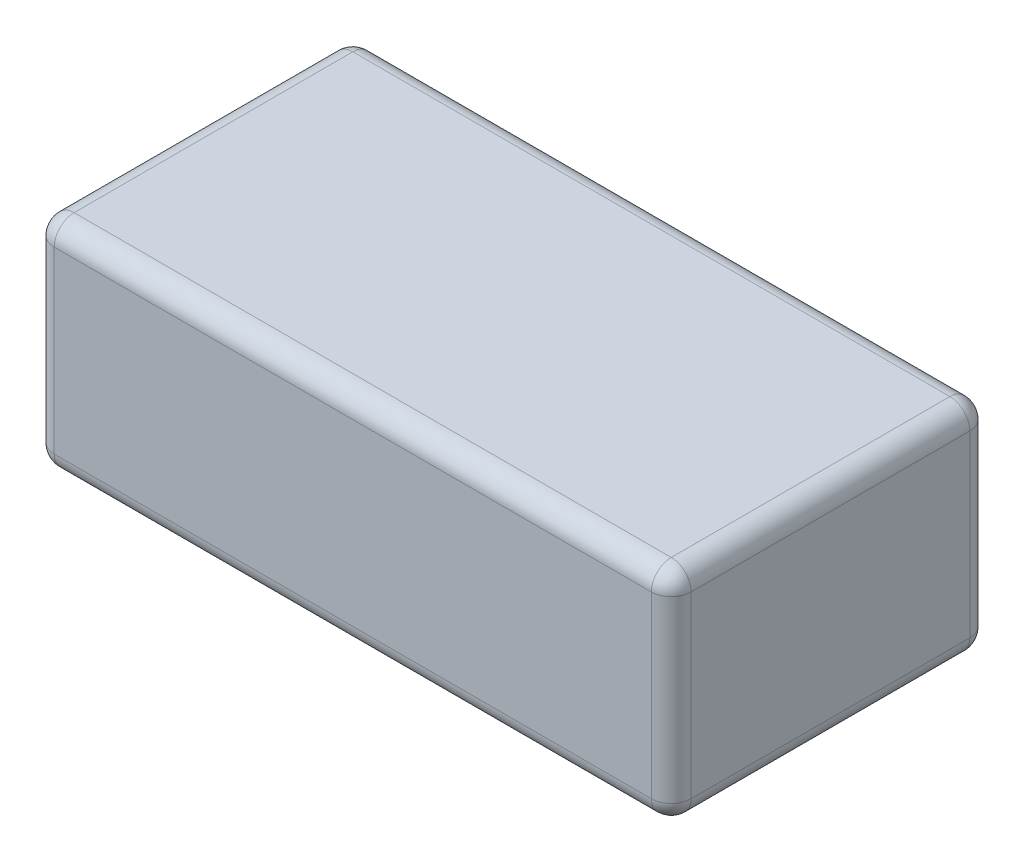
ISO-10303-21;
HEADER;
FILE_DESCRIPTION(('STEP AP214'),'2;1');
FILE_NAME('part.step','',(''),(''),'','','');
FILE_SCHEMA(('AUTOMOTIVE_DESIGN { 1 0 10303 214 1 1 1 1 }'));
ENDSEC;
DATA;
#1=APPLICATION_CONTEXT('core data for automotive mechanical design processes');
#2=APPLICATION_PROTOCOL_DEFINITION('international standard','automotive_design',2000,#1);
#3=PRODUCT_CONTEXT('',#1,'mechanical');
#4=PRODUCT('Part','Part','',(#3));
#5=PRODUCT_RELATED_PRODUCT_CATEGORY('part','',(#4));
#6=PRODUCT_DEFINITION_FORMATION('','',#4);
#7=PRODUCT_DEFINITION_CONTEXT('part definition',#1,'design');
#8=PRODUCT_DEFINITION('design','',#6,#7);
#9=PRODUCT_DEFINITION_SHAPE('','',#8);
#10=(LENGTH_UNIT() NAMED_UNIT(*) SI_UNIT(.MILLI.,.METRE.));
#11=(NAMED_UNIT(*) PLANE_ANGLE_UNIT() SI_UNIT($,.RADIAN.));
#12=(NAMED_UNIT(*) SI_UNIT($,.STERADIAN.) SOLID_ANGLE_UNIT());
#13=UNCERTAINTY_MEASURE_WITH_UNIT(LENGTH_MEASURE(1.E-05),#10,'distance_accuracy_value','');
#14=(GEOMETRIC_REPRESENTATION_CONTEXT(3) GLOBAL_UNCERTAINTY_ASSIGNED_CONTEXT((#13)) GLOBAL_UNIT_ASSIGNED_CONTEXT((#10,
#11,#12)) REPRESENTATION_CONTEXT('',''));
#15=CARTESIAN_POINT('',(0.,0.,0.));
#16=DIRECTION('',(0.,0.,1.));
#17=DIRECTION('',(1.,0.,0.));
#18=AXIS2_PLACEMENT_3D('',#15,#16,#17);
#19=CARTESIAN_POINT('',(0.75,0.05,0.35));
#20=DIRECTION('',(1.,0.,0.));
#21=DIRECTION('',(0.,0.,-1.));
#22=AXIS2_PLACEMENT_3D('',#19,#20,#21);
#23=SPHERICAL_SURFACE('',#22,0.05);
#24=CARTESIAN_POINT('',(0.75,0.05,0.35));
#25=DIRECTION('',(-1.,0.,0.));
#26=DIRECTION('',(0.,0.,1.));
#27=AXIS2_PLACEMENT_3D('',#24,#25,#26);
#28=CIRCLE('',#27,0.05);
#29=CARTESIAN_POINT('',(0.75,0.,0.35));
#30=VERTEX_POINT('',#29);
#31=CARTESIAN_POINT('',(0.75,0.049999999999988,0.4));
#32=VERTEX_POINT('',#31);
#33=EDGE_CURVE('E111',#30,#32,#28,.T.);
#34=ORIENTED_EDGE('',*,*,#33,.F.);
#35=CARTESIAN_POINT('',(0.75,0.05,0.35));
#36=DIRECTION('',(0.,0.,1.));
#37=DIRECTION('',(1.,0.,0.));
#38=AXIS2_PLACEMENT_3D('',#35,#36,#37);
#39=CIRCLE('',#38,0.05);
#40=CARTESIAN_POINT('',(0.8,0.05,0.35));
#41=VERTEX_POINT('',#40);
#42=EDGE_CURVE('E122',#41,#30,#39,.F.);
#43=ORIENTED_EDGE('',*,*,#42,.F.);
#44=CARTESIAN_POINT('',(0.75,0.05,0.35));
#45=DIRECTION('',(0.,-1.,0.));
#46=DIRECTION('',(0.,0.,-1.));
#47=AXIS2_PLACEMENT_3D('',#44,#45,#46);
#48=CIRCLE('',#47,0.05);
#49=EDGE_CURVE('E131',#32,#41,#48,.F.);
#50=ORIENTED_EDGE('',*,*,#49,.F.);
#51=EDGE_LOOP('',(#34,#43,#50));
#52=FACE_BOUND('',#51,.T.);
#53=ADVANCED_FACE('F17',(#52),#23,.T.);
#54=CARTESIAN_POINT('',(-0.75,0.05,0.35));
#55=DIRECTION('',(1.,0.,0.));
#56=DIRECTION('',(0.,0.,-1.));
#57=AXIS2_PLACEMENT_3D('',#54,#55,#56);
#58=SPHERICAL_SURFACE('',#57,0.05);
#59=CARTESIAN_POINT('',(-0.75,0.05,0.35));
#60=DIRECTION('',(0.,-1.,0.));
#61=DIRECTION('',(0.,0.,-1.));
#62=AXIS2_PLACEMENT_3D('',#59,#60,#61);
#63=CIRCLE('',#62,0.05);
#64=CARTESIAN_POINT('',(-0.8,0.05,0.35));
#65=VERTEX_POINT('',#64);
#66=CARTESIAN_POINT('',(-0.75,0.05,0.4));
#67=VERTEX_POINT('',#66);
#68=EDGE_CURVE('E261',#65,#67,#63,.F.);
#69=ORIENTED_EDGE('',*,*,#68,.F.);
#70=CARTESIAN_POINT('',(-0.75,0.05,0.35));
#71=DIRECTION('',(0.,0.,-1.));
#72=DIRECTION('',(-1.,0.,0.));
#73=AXIS2_PLACEMENT_3D('',#70,#71,#72);
#74=CIRCLE('',#73,0.05);
#75=CARTESIAN_POINT('',(-0.75,0.,0.35));
#76=VERTEX_POINT('',#75);
#77=EDGE_CURVE('E270',#76,#65,#74,.T.);
#78=ORIENTED_EDGE('',*,*,#77,.F.);
#79=CARTESIAN_POINT('',(-0.75,0.05,0.35));
#80=DIRECTION('',(-1.,0.,0.));
#81=DIRECTION('',(0.,0.,1.));
#82=AXIS2_PLACEMENT_3D('',#79,#80,#81);
#83=CIRCLE('',#82,0.05);
#84=EDGE_CURVE('E114',#67,#76,#83,.F.);
#85=ORIENTED_EDGE('',*,*,#84,.F.);
#86=EDGE_LOOP('',(#69,#78,#85));
#87=FACE_BOUND('',#86,.T.);
#88=ADVANCED_FACE('F151',(#87),#58,.T.);
#89=CARTESIAN_POINT('',(-0.75,0.05,-0.35));
#90=DIRECTION('',(1.,0.,0.));
#91=DIRECTION('',(0.,0.,-1.));
#92=AXIS2_PLACEMENT_3D('',#89,#90,#91);
#93=SPHERICAL_SURFACE('',#92,0.05);
#94=CARTESIAN_POINT('',(-0.75,0.05,-0.35));
#95=DIRECTION('',(0.,-1.,0.));
#96=DIRECTION('',(0.,0.,-1.));
#97=AXIS2_PLACEMENT_3D('',#94,#95,#96);
#98=CIRCLE('',#97,0.05);
#99=CARTESIAN_POINT('',(-0.75,0.05,-0.4));
#100=VERTEX_POINT('',#99);
#101=CARTESIAN_POINT('',(-0.8,0.05,-0.35));
#102=VERTEX_POINT('',#101);
#103=EDGE_CURVE('E256',#100,#102,#98,.F.);
#104=ORIENTED_EDGE('',*,*,#103,.F.);
#105=CARTESIAN_POINT('',(-0.75,0.05,-0.35));
#106=DIRECTION('',(1.,0.,0.));
#107=DIRECTION('',(0.,0.,-1.));
#108=AXIS2_PLACEMENT_3D('',#105,#106,#107);
#109=CIRCLE('',#108,0.05);
#110=CARTESIAN_POINT('',(-0.75,0.,-0.35));
#111=VERTEX_POINT('',#110);
#112=EDGE_CURVE('E253',#111,#100,#109,.T.);
#113=ORIENTED_EDGE('',*,*,#112,.F.);
#114=CARTESIAN_POINT('',(-0.75,0.05,-0.35));
#115=DIRECTION('',(0.,0.,-1.));
#116=DIRECTION('',(-1.,0.,0.));
#117=AXIS2_PLACEMENT_3D('',#114,#115,#116);
#118=CIRCLE('',#117,0.05);
#119=EDGE_CURVE('E267',#102,#111,#118,.F.);
#120=ORIENTED_EDGE('',*,*,#119,.F.);
#121=EDGE_LOOP('',(#104,#113,#120));
#122=FACE_BOUND('',#121,.T.);
#123=ADVANCED_FACE('F147',(#122),#93,.T.);
#124=CARTESIAN_POINT('',(0.75,0.05,-0.35));
#125=DIRECTION('',(1.,0.,0.));
#126=DIRECTION('',(0.,0.,-1.));
#127=AXIS2_PLACEMENT_3D('',#124,#125,#126);
#128=SPHERICAL_SURFACE('',#127,0.05);
#129=CARTESIAN_POINT('',(0.75,0.05,-0.35));
#130=DIRECTION('',(1.,0.,0.));
#131=DIRECTION('',(0.,0.,-1.));
#132=AXIS2_PLACEMENT_3D('',#129,#130,#131);
#133=CIRCLE('',#132,0.05);
#134=CARTESIAN_POINT('',(0.75,0.05,-0.4));
#135=VERTEX_POINT('',#134);
#136=CARTESIAN_POINT('',(0.75,0.,-0.35));
#137=VERTEX_POINT('',#136);
#138=EDGE_CURVE('E251',#135,#137,#133,.F.);
#139=ORIENTED_EDGE('',*,*,#138,.F.);
#140=CARTESIAN_POINT('',(0.75,0.05,-0.35));
#141=DIRECTION('',(0.,-1.,0.));
#142=DIRECTION('',(0.,0.,-1.));
#143=AXIS2_PLACEMENT_3D('',#140,#141,#142);
#144=CIRCLE('',#143,0.05);
#145=CARTESIAN_POINT('',(0.8,0.05,-0.35));
#146=VERTEX_POINT('',#145);
#147=EDGE_CURVE('E258',#146,#135,#144,.F.);
#148=ORIENTED_EDGE('',*,*,#147,.F.);
#149=CARTESIAN_POINT('',(0.75,0.05,-0.35));
#150=DIRECTION('',(0.,0.,1.));
#151=DIRECTION('',(1.,0.,0.));
#152=AXIS2_PLACEMENT_3D('',#149,#150,#151);
#153=CIRCLE('',#152,0.05);
#154=EDGE_CURVE('E133',#137,#146,#153,.T.);
#155=ORIENTED_EDGE('',*,*,#154,.F.);
#156=EDGE_LOOP('',(#139,#148,#155));
#157=FACE_BOUND('',#156,.T.);
#158=ADVANCED_FACE('F143',(#157),#128,.T.);
#159=CARTESIAN_POINT('',(0.75,0.05,0.4));
#160=DIRECTION('',(0.,0.,1.));
#161=DIRECTION('',(1.,0.,0.));
#162=AXIS2_PLACEMENT_3D('',#159,#160,#161);
#163=CYLINDRICAL_SURFACE('',#162,0.05);
#164=ORIENTED_EDGE('',*,*,#154,.T.);
#165=DIRECTION('',(0.,0.,1.));
#166=VECTOR('',#165,1.);
#167=CARTESIAN_POINT('',(0.8,0.05,0.4));
#168=LINE('',#167,#166);
#169=EDGE_CURVE('E127',#146,#41,#168,.T.);
#170=ORIENTED_EDGE('',*,*,#169,.T.);
#171=ORIENTED_EDGE('',*,*,#42,.T.);
#172=DIRECTION('',(0.,0.,1.));
#173=VECTOR('',#172,1.);
#174=CARTESIAN_POINT('',(0.75,0.,0.4));
#175=LINE('',#174,#173);
#176=EDGE_CURVE('E124',#30,#137,#175,.F.);
#177=ORIENTED_EDGE('',*,*,#176,.T.);
#178=EDGE_LOOP('',(#164,#170,#171,#177));
#179=FACE_BOUND('',#178,.T.);
#180=ADVANCED_FACE('F123',(#179),#163,.T.);
#181=CARTESIAN_POINT('',(0.75,0.55,0.35));
#182=DIRECTION('',(0.,-1.,0.));
#183=DIRECTION('',(0.,0.,-1.));
#184=AXIS2_PLACEMENT_3D('',#181,#182,#183);
#185=CYLINDRICAL_SURFACE('',#184,0.05);
#186=ORIENTED_EDGE('',*,*,#49,.T.);
#187=DIRECTION('',(0.,1.,0.));
#188=VECTOR('',#187,1.);
#189=CARTESIAN_POINT('',(0.8,0.55,0.35));
#190=LINE('',#189,#188);
#191=CARTESIAN_POINT('',(0.8,0.5,0.35));
#192=VERTEX_POINT('',#191);
#193=EDGE_CURVE('E247',#41,#192,#190,.T.);
#194=ORIENTED_EDGE('',*,*,#193,.T.);
#195=CARTESIAN_POINT('',(0.75,0.5,0.35));
#196=DIRECTION('',(0.,-1.,0.));
#197=DIRECTION('',(1.,0.,0.));
#198=AXIS2_PLACEMENT_3D('',#195,#196,#197);
#199=CIRCLE('',#198,0.05);
#200=CARTESIAN_POINT('',(0.75,0.5,0.4));
#201=VERTEX_POINT('',#200);
#202=EDGE_CURVE('E242',#201,#192,#199,.F.);
#203=ORIENTED_EDGE('',*,*,#202,.F.);
#204=DIRECTION('',(0.,1.,0.));
#205=VECTOR('',#204,1.);
#206=CARTESIAN_POINT('',(0.75,0.55,0.4));
#207=LINE('',#206,#205);
#208=EDGE_CURVE('E116',#201,#32,#207,.F.);
#209=ORIENTED_EDGE('',*,*,#208,.T.);
#210=EDGE_LOOP('',(#186,#194,#203,#209));
#211=FACE_BOUND('',#210,.T.);
#212=ADVANCED_FACE('F274',(#211),#185,.T.);
#213=CARTESIAN_POINT('',(-0.75,0.05,0.4));
#214=DIRECTION('',(0.,0.,-1.));
#215=DIRECTION('',(-1.,0.,0.));
#216=AXIS2_PLACEMENT_3D('',#213,#214,#215);
#217=CYLINDRICAL_SURFACE('',#216,0.05);
#218=ORIENTED_EDGE('',*,*,#119,.T.);
#219=DIRECTION('',(0.,0.,-1.));
#220=VECTOR('',#219,1.);
#221=CARTESIAN_POINT('',(-0.75,0.,0.4));
#222=LINE('',#221,#220);
#223=EDGE_CURVE('E264',#111,#76,#222,.F.);
#224=ORIENTED_EDGE('',*,*,#223,.T.);
#225=ORIENTED_EDGE('',*,*,#77,.T.);
#226=DIRECTION('',(0.,0.,-1.));
#227=VECTOR('',#226,1.);
#228=CARTESIAN_POINT('',(-0.8,0.05,0.4));
#229=LINE('',#228,#227);
#230=EDGE_CURVE('E220',#65,#102,#229,.T.);
#231=ORIENTED_EDGE('',*,*,#230,.T.);
#232=EDGE_LOOP('',(#218,#224,#225,#231));
#233=FACE_BOUND('',#232,.T.);
#234=ADVANCED_FACE('F361',(#233),#217,.T.);
#235=CARTESIAN_POINT('',(-0.75,0.55,0.35));
#236=DIRECTION('',(0.,-1.,0.));
#237=DIRECTION('',(0.,0.,-1.));
#238=AXIS2_PLACEMENT_3D('',#235,#236,#237);
#239=CYLINDRICAL_SURFACE('',#238,0.05);
#240=ORIENTED_EDGE('',*,*,#68,.T.);
#241=DIRECTION('',(0.,1.,0.));
#242=VECTOR('',#241,1.);
#243=CARTESIAN_POINT('',(-0.75,0.55,0.4));
#244=LINE('',#243,#242);
#245=CARTESIAN_POINT('',(-0.75,0.5,0.4));
#246=VERTEX_POINT('',#245);
#247=EDGE_CURVE('E241',#67,#246,#244,.T.);
#248=ORIENTED_EDGE('',*,*,#247,.T.);
#249=CARTESIAN_POINT('',(-0.75,0.5,0.35));
#250=DIRECTION('',(0.,-1.,0.));
#251=DIRECTION('',(1.,0.,0.));
#252=AXIS2_PLACEMENT_3D('',#249,#250,#251);
#253=CIRCLE('',#252,0.05);
#254=CARTESIAN_POINT('',(-0.8,0.5,0.35));
#255=VERTEX_POINT('',#254);
#256=EDGE_CURVE('E223',#255,#246,#253,.F.);
#257=ORIENTED_EDGE('',*,*,#256,.F.);
#258=DIRECTION('',(0.,1.,0.));
#259=VECTOR('',#258,1.);
#260=CARTESIAN_POINT('',(-0.8,0.55,0.35));
#261=LINE('',#260,#259);
#262=EDGE_CURVE('E214',#255,#65,#261,.F.);
#263=ORIENTED_EDGE('',*,*,#262,.T.);
#264=EDGE_LOOP('',(#240,#248,#257,#263));
#265=FACE_BOUND('',#264,.T.);
#266=ADVANCED_FACE('F359',(#265),#239,.T.);
#267=CARTESIAN_POINT('',(0.75,0.55,-0.35));
#268=DIRECTION('',(0.,-1.,0.));
#269=DIRECTION('',(0.,0.,-1.));
#270=AXIS2_PLACEMENT_3D('',#267,#268,#269);
#271=CYLINDRICAL_SURFACE('',#270,0.05);
#272=ORIENTED_EDGE('',*,*,#147,.T.);
#273=DIRECTION('',(0.,1.,0.));
#274=VECTOR('',#273,1.);
#275=CARTESIAN_POINT('',(0.75,0.55,-0.4));
#276=LINE('',#275,#274);
#277=CARTESIAN_POINT('',(0.75,0.5,-0.4));
#278=VERTEX_POINT('',#277);
#279=EDGE_CURVE('E206',#135,#278,#276,.T.);
#280=ORIENTED_EDGE('',*,*,#279,.T.);
#281=CARTESIAN_POINT('',(0.75,0.5,-0.35));
#282=DIRECTION('',(0.,1.,0.));
#283=DIRECTION('',(1.,0.,0.));
#284=AXIS2_PLACEMENT_3D('',#281,#282,#283);
#285=CIRCLE('',#284,0.05);
#286=CARTESIAN_POINT('',(0.8,0.5,-0.35));
#287=VERTEX_POINT('',#286);
#288=EDGE_CURVE('E208',#287,#278,#285,.T.);
#289=ORIENTED_EDGE('',*,*,#288,.F.);
#290=DIRECTION('',(0.,1.,0.));
#291=VECTOR('',#290,1.);
#292=CARTESIAN_POINT('',(0.8,0.55,-0.35));
#293=LINE('',#292,#291);
#294=EDGE_CURVE('E117',#287,#146,#293,.F.);
#295=ORIENTED_EDGE('',*,*,#294,.T.);
#296=EDGE_LOOP('',(#272,#280,#289,#295));
#297=FACE_BOUND('',#296,.T.);
#298=ADVANCED_FACE('F310',(#297),#271,.T.);
#299=CARTESIAN_POINT('',(-0.75,0.55,-0.35));
#300=DIRECTION('',(0.,-1.,0.));
#301=DIRECTION('',(0.,0.,-1.));
#302=AXIS2_PLACEMENT_3D('',#299,#300,#301);
#303=CYLINDRICAL_SURFACE('',#302,0.05);
#304=CARTESIAN_POINT('',(-0.75,0.5,-0.35));
#305=DIRECTION('',(0.,1.,0.));
#306=DIRECTION('',(1.,0.,0.));
#307=AXIS2_PLACEMENT_3D('',#304,#305,#306);
#308=CIRCLE('',#307,0.05);
#309=CARTESIAN_POINT('',(-0.75,0.5,-0.4));
#310=VERTEX_POINT('',#309);
#311=CARTESIAN_POINT('',(-0.8,0.5,-0.35));
#312=VERTEX_POINT('',#311);
#313=EDGE_CURVE('E210',#310,#312,#308,.T.);
#314=ORIENTED_EDGE('',*,*,#313,.F.);
#315=DIRECTION('',(0.,1.,0.));
#316=VECTOR('',#315,1.);
#317=CARTESIAN_POINT('',(-0.75,0.55,-0.4));
#318=LINE('',#317,#316);
#319=EDGE_CURVE('E300',#310,#100,#318,.F.);
#320=ORIENTED_EDGE('',*,*,#319,.T.);
#321=ORIENTED_EDGE('',*,*,#103,.T.);
#322=DIRECTION('',(0.,1.,0.));
#323=VECTOR('',#322,1.);
#324=CARTESIAN_POINT('',(-0.8,0.55,-0.35));
#325=LINE('',#324,#323);
#326=EDGE_CURVE('E217',#102,#312,#325,.T.);
#327=ORIENTED_EDGE('',*,*,#326,.T.);
#328=EDGE_LOOP('',(#314,#320,#321,#327));
#329=FACE_BOUND('',#328,.T.);
#330=ADVANCED_FACE('F351',(#329),#303,.T.);
#331=CARTESIAN_POINT('',(0.8,0.,-0.4));
#332=DIRECTION('',(0.,-1.,0.));
#333=DIRECTION('',(0.,0.,-1.));
#334=AXIS2_PLACEMENT_3D('',#331,#332,#333);
#335=PLANE('',#334);
#336=DIRECTION('',(1.,0.,0.));
#337=VECTOR('',#336,1.);
#338=CARTESIAN_POINT('',(-0.8,0.,-0.35));
#339=LINE('',#338,#337);
#340=EDGE_CURVE('E101',#137,#111,#339,.F.);
#341=ORIENTED_EDGE('',*,*,#340,.F.);
#342=ORIENTED_EDGE('',*,*,#176,.F.);
#343=DIRECTION('',(-1.,0.,0.));
#344=VECTOR('',#343,1.);
#345=CARTESIAN_POINT('',(-0.8,0.,0.35));
#346=LINE('',#345,#344);
#347=EDGE_CURVE('E107',#76,#30,#346,.F.);
#348=ORIENTED_EDGE('',*,*,#347,.F.);
#349=ORIENTED_EDGE('',*,*,#223,.F.);
#350=EDGE_LOOP('',(#341,#342,#348,#349));
#351=FACE_BOUND('',#350,.T.);
#352=ADVANCED_FACE('F135',(#351),#335,.T.);
#353=CARTESIAN_POINT('',(0.8,0.55,0.4));
#354=DIRECTION('',(-1.,0.,0.));
#355=DIRECTION('',(0.,0.,1.));
#356=AXIS2_PLACEMENT_3D('',#353,#354,#355);
#357=PLANE('',#356);
#358=DIRECTION('',(0.,0.,-1.));
#359=VECTOR('',#358,1.);
#360=CARTESIAN_POINT('',(0.8,0.5,-0.4));
#361=LINE('',#360,#359);
#362=EDGE_CURVE('E291',#192,#287,#361,.T.);
#363=ORIENTED_EDGE('',*,*,#362,.F.);
#364=ORIENTED_EDGE('',*,*,#193,.F.);
#365=ORIENTED_EDGE('',*,*,#169,.F.);
#366=ORIENTED_EDGE('',*,*,#294,.F.);
#367=EDGE_LOOP('',(#363,#364,#365,#366));
#368=FACE_BOUND('',#367,.T.);
#369=ADVANCED_FACE('F346',(#368),#357,.F.);
#370=CARTESIAN_POINT('',(-0.8,0.05,0.35));
#371=DIRECTION('',(-1.,0.,0.));
#372=DIRECTION('',(0.,0.,1.));
#373=AXIS2_PLACEMENT_3D('',#370,#371,#372);
#374=CYLINDRICAL_SURFACE('',#373,0.05);
#375=ORIENTED_EDGE('',*,*,#347,.T.);
#376=ORIENTED_EDGE('',*,*,#33,.T.);
#377=DIRECTION('',(-1.,0.,0.));
#378=VECTOR('',#377,1.);
#379=CARTESIAN_POINT('',(-0.8,0.05,0.4));
#380=LINE('',#379,#378);
#381=EDGE_CURVE('E282',#32,#67,#380,.T.);
#382=ORIENTED_EDGE('',*,*,#381,.T.);
#383=ORIENTED_EDGE('',*,*,#84,.T.);
#384=EDGE_LOOP('',(#375,#376,#382,#383));
#385=FACE_BOUND('',#384,.T.);
#386=ADVANCED_FACE('F109',(#385),#374,.T.);
#387=CARTESIAN_POINT('',(0.75,0.5,0.35));
#388=DIRECTION('',(1.,0.,0.));
#389=DIRECTION('',(0.,0.,-1.));
#390=AXIS2_PLACEMENT_3D('',#387,#388,#389);
#391=SPHERICAL_SURFACE('',#390,0.05);
#392=ORIENTED_EDGE('',*,*,#202,.T.);
#393=CARTESIAN_POINT('',(0.75,0.5,0.35));
#394=DIRECTION('',(0.,0.,-1.));
#395=DIRECTION('',(-1.,0.,0.));
#396=AXIS2_PLACEMENT_3D('',#393,#394,#395);
#397=CIRCLE('',#396,0.05);
#398=CARTESIAN_POINT('',(0.75,0.55,0.349999999999904));
#399=VERTEX_POINT('',#398);
#400=EDGE_CURVE('E297',#399,#192,#397,.T.);
#401=ORIENTED_EDGE('',*,*,#400,.F.);
#402=CARTESIAN_POINT('',(0.75,0.5,0.35));
#403=DIRECTION('',(1.,0.,0.));
#404=DIRECTION('',(0.,0.,-1.));
#405=AXIS2_PLACEMENT_3D('',#402,#403,#404);
#406=CIRCLE('',#405,0.05);
#407=EDGE_CURVE('E284',#201,#399,#406,.F.);
#408=ORIENTED_EDGE('',*,*,#407,.F.);
#409=EDGE_LOOP('',(#392,#401,#408));
#410=FACE_BOUND('',#409,.T.);
#411=ADVANCED_FACE('F232',(#410),#391,.T.);
#412=CARTESIAN_POINT('',(-0.75,0.5,0.35));
#413=DIRECTION('',(1.,0.,0.));
#414=DIRECTION('',(0.,0.,-1.));
#415=AXIS2_PLACEMENT_3D('',#412,#413,#414);
#416=SPHERICAL_SURFACE('',#415,0.05);
#417=ORIENTED_EDGE('',*,*,#256,.T.);
#418=CARTESIAN_POINT('',(-0.75,0.5,0.35));
#419=DIRECTION('',(1.,0.,0.));
#420=DIRECTION('',(0.,0.,-1.));
#421=AXIS2_PLACEMENT_3D('',#418,#419,#420);
#422=CIRCLE('',#421,0.05);
#423=CARTESIAN_POINT('',(-0.75,0.55,0.35));
#424=VERTEX_POINT('',#423);
#425=EDGE_CURVE('E288',#424,#246,#422,.T.);
#426=ORIENTED_EDGE('',*,*,#425,.F.);
#427=CARTESIAN_POINT('',(-0.75,0.5,0.35));
#428=DIRECTION('',(0.,0.,1.));
#429=DIRECTION('',(1.,0.,0.));
#430=AXIS2_PLACEMENT_3D('',#427,#428,#429);
#431=CIRCLE('',#430,0.05);
#432=EDGE_CURVE('E331',#255,#424,#431,.F.);
#433=ORIENTED_EDGE('',*,*,#432,.F.);
#434=EDGE_LOOP('',(#417,#426,#433));
#435=FACE_BOUND('',#434,.T.);
#436=ADVANCED_FACE('F228',(#435),#416,.T.);
#437=CARTESIAN_POINT('',(-0.8,0.55,0.4));
#438=DIRECTION('',(1.,0.,0.));
#439=DIRECTION('',(0.,0.,-1.));
#440=AXIS2_PLACEMENT_3D('',#437,#438,#439);
#441=PLANE('',#440);
#442=DIRECTION('',(0.,0.,1.));
#443=VECTOR('',#442,1.);
#444=CARTESIAN_POINT('',(-0.8,0.5,-0.4));
#445=LINE('',#444,#443);
#446=EDGE_CURVE('E322',#312,#255,#445,.T.);
#447=ORIENTED_EDGE('',*,*,#446,.F.);
#448=ORIENTED_EDGE('',*,*,#326,.F.);
#449=ORIENTED_EDGE('',*,*,#230,.F.);
#450=ORIENTED_EDGE('',*,*,#262,.F.);
#451=EDGE_LOOP('',(#447,#448,#449,#450));
#452=FACE_BOUND('',#451,.T.);
#453=ADVANCED_FACE('F231',(#452),#441,.F.);
#454=CARTESIAN_POINT('',(-0.75,0.5,-0.35));
#455=DIRECTION('',(1.,0.,0.));
#456=DIRECTION('',(0.,0.,-1.));
#457=AXIS2_PLACEMENT_3D('',#454,#455,#456);
#458=SPHERICAL_SURFACE('',#457,0.05);
#459=CARTESIAN_POINT('',(-0.75,0.5,-0.35));
#460=DIRECTION('',(0.,0.,1.));
#461=DIRECTION('',(1.,0.,0.));
#462=AXIS2_PLACEMENT_3D('',#459,#460,#461);
#463=CIRCLE('',#462,0.05);
#464=CARTESIAN_POINT('',(-0.75,0.55,-0.35));
#465=VERTEX_POINT('',#464);
#466=EDGE_CURVE('E328',#465,#312,#463,.T.);
#467=ORIENTED_EDGE('',*,*,#466,.F.);
#468=CARTESIAN_POINT('',(-0.75,0.5,-0.35));
#469=DIRECTION('',(-1.,0.,0.));
#470=DIRECTION('',(0.,0.,1.));
#471=AXIS2_PLACEMENT_3D('',#468,#469,#470);
#472=CIRCLE('',#471,0.05);
#473=EDGE_CURVE('E318',#310,#465,#472,.F.);
#474=ORIENTED_EDGE('',*,*,#473,.F.);
#475=ORIENTED_EDGE('',*,*,#313,.T.);
#476=EDGE_LOOP('',(#467,#474,#475));
#477=FACE_BOUND('',#476,.T.);
#478=ADVANCED_FACE('F199',(#477),#458,.T.);
#479=CARTESIAN_POINT('',(0.75,0.5,-0.35));
#480=DIRECTION('',(1.,0.,0.));
#481=DIRECTION('',(0.,0.,-1.));
#482=AXIS2_PLACEMENT_3D('',#479,#480,#481);
#483=SPHERICAL_SURFACE('',#482,0.05);
#484=CARTESIAN_POINT('',(0.75,0.5,-0.35));
#485=DIRECTION('',(0.,0.,-1.));
#486=DIRECTION('',(-1.,0.,0.));
#487=AXIS2_PLACEMENT_3D('',#484,#485,#486);
#488=CIRCLE('',#487,0.05);
#489=CARTESIAN_POINT('',(0.75,0.55,-0.35));
#490=VERTEX_POINT('',#489);
#491=EDGE_CURVE('E285',#287,#490,#488,.F.);
#492=ORIENTED_EDGE('',*,*,#491,.F.);
#493=ORIENTED_EDGE('',*,*,#288,.T.);
#494=CARTESIAN_POINT('',(0.75,0.5,-0.35));
#495=DIRECTION('',(-1.,0.,0.));
#496=DIRECTION('',(0.,0.,1.));
#497=AXIS2_PLACEMENT_3D('',#494,#495,#496);
#498=CIRCLE('',#497,0.05);
#499=EDGE_CURVE('E315',#490,#278,#498,.T.);
#500=ORIENTED_EDGE('',*,*,#499,.F.);
#501=EDGE_LOOP('',(#492,#493,#500));
#502=FACE_BOUND('',#501,.T.);
#503=ADVANCED_FACE('F194',(#502),#483,.T.);
#504=CARTESIAN_POINT('',(-0.8,0.05,-0.35));
#505=DIRECTION('',(1.,0.,0.));
#506=DIRECTION('',(0.,0.,-1.));
#507=AXIS2_PLACEMENT_3D('',#504,#505,#506);
#508=CYLINDRICAL_SURFACE('',#507,0.05);
#509=DIRECTION('',(1.,0.,0.));
#510=VECTOR('',#509,1.);
#511=CARTESIAN_POINT('',(-0.8,0.05,-0.4));
#512=LINE('',#511,#510);
#513=EDGE_CURVE('E317',#100,#135,#512,.T.);
#514=ORIENTED_EDGE('',*,*,#513,.T.);
#515=ORIENTED_EDGE('',*,*,#138,.T.);
#516=ORIENTED_EDGE('',*,*,#340,.T.);
#517=ORIENTED_EDGE('',*,*,#112,.T.);
#518=EDGE_LOOP('',(#514,#515,#516,#517));
#519=FACE_BOUND('',#518,.T.);
#520=ADVANCED_FACE('F190',(#519),#508,.T.);
#521=CARTESIAN_POINT('',(0.75,0.5,-0.4));
#522=DIRECTION('',(0.,0.,-1.));
#523=DIRECTION('',(-1.,0.,0.));
#524=AXIS2_PLACEMENT_3D('',#521,#522,#523);
#525=CYLINDRICAL_SURFACE('',#524,0.05);
#526=ORIENTED_EDGE('',*,*,#491,.T.);
#527=DIRECTION('',(0.,0.,-1.));
#528=VECTOR('',#527,1.);
#529=CARTESIAN_POINT('',(0.75,0.55,-0.4));
#530=LINE('',#529,#528);
#531=EDGE_CURVE('E320',#490,#399,#530,.F.);
#532=ORIENTED_EDGE('',*,*,#531,.T.);
#533=ORIENTED_EDGE('',*,*,#400,.T.);
#534=ORIENTED_EDGE('',*,*,#362,.T.);
#535=EDGE_LOOP('',(#526,#532,#533,#534));
#536=FACE_BOUND('',#535,.T.);
#537=ADVANCED_FACE('F186',(#536),#525,.T.);
#538=CARTESIAN_POINT('',(-0.8,0.55,0.4));
#539=DIRECTION('',(0.,0.,-1.));
#540=DIRECTION('',(-1.,0.,0.));
#541=AXIS2_PLACEMENT_3D('',#538,#539,#540);
#542=PLANE('',#541);
#543=DIRECTION('',(1.,0.,0.));
#544=VECTOR('',#543,1.);
#545=CARTESIAN_POINT('',(0.8,0.5,0.4));
#546=LINE('',#545,#544);
#547=EDGE_CURVE('E280',#246,#201,#546,.T.);
#548=ORIENTED_EDGE('',*,*,#547,.F.);
#549=ORIENTED_EDGE('',*,*,#247,.F.);
#550=ORIENTED_EDGE('',*,*,#381,.F.);
#551=ORIENTED_EDGE('',*,*,#208,.F.);
#552=EDGE_LOOP('',(#548,#549,#550,#551));
#553=FACE_BOUND('',#552,.T.);
#554=ADVANCED_FACE('F182',(#553),#542,.F.);
#555=CARTESIAN_POINT('',(-0.75,0.5,-0.4));
#556=DIRECTION('',(0.,0.,1.));
#557=DIRECTION('',(1.,0.,0.));
#558=AXIS2_PLACEMENT_3D('',#555,#556,#557);
#559=CYLINDRICAL_SURFACE('',#558,0.05);
#560=ORIENTED_EDGE('',*,*,#466,.T.);
#561=ORIENTED_EDGE('',*,*,#446,.T.);
#562=ORIENTED_EDGE('',*,*,#432,.T.);
#563=DIRECTION('',(0.,0.,-1.));
#564=VECTOR('',#563,1.);
#565=CARTESIAN_POINT('',(-0.75,0.55,-0.4));
#566=LINE('',#565,#564);
#567=EDGE_CURVE('E338',#424,#465,#566,.T.);
#568=ORIENTED_EDGE('',*,*,#567,.T.);
#569=EDGE_LOOP('',(#560,#561,#562,#568));
#570=FACE_BOUND('',#569,.T.);
#571=ADVANCED_FACE('F178',(#570),#559,.T.);
#572=CARTESIAN_POINT('',(-0.8,0.55,-0.4));
#573=DIRECTION('',(0.,0.,1.));
#574=DIRECTION('',(1.,0.,0.));
#575=AXIS2_PLACEMENT_3D('',#572,#573,#574);
#576=PLANE('',#575);
#577=ORIENTED_EDGE('',*,*,#513,.F.);
#578=ORIENTED_EDGE('',*,*,#319,.F.);
#579=DIRECTION('',(-1.,0.,0.));
#580=VECTOR('',#579,1.);
#581=CARTESIAN_POINT('',(0.8,0.5,-0.4));
#582=LINE('',#581,#580);
#583=EDGE_CURVE('E316',#278,#310,#582,.T.);
#584=ORIENTED_EDGE('',*,*,#583,.F.);
#585=ORIENTED_EDGE('',*,*,#279,.F.);
#586=EDGE_LOOP('',(#577,#578,#584,#585));
#587=FACE_BOUND('',#586,.T.);
#588=ADVANCED_FACE('F174',(#587),#576,.F.);
#589=CARTESIAN_POINT('',(0.8,0.5,0.35));
#590=DIRECTION('',(1.,0.,0.));
#591=DIRECTION('',(0.,0.,-1.));
#592=AXIS2_PLACEMENT_3D('',#589,#590,#591);
#593=CYLINDRICAL_SURFACE('',#592,0.05);
#594=ORIENTED_EDGE('',*,*,#547,.T.);
#595=ORIENTED_EDGE('',*,*,#407,.T.);
#596=DIRECTION('',(1.,0.,0.));
#597=VECTOR('',#596,1.);
#598=CARTESIAN_POINT('',(0.8,0.55,0.35));
#599=LINE('',#598,#597);
#600=EDGE_CURVE('E26',#399,#424,#599,.F.);
#601=ORIENTED_EDGE('',*,*,#600,.T.);
#602=ORIENTED_EDGE('',*,*,#425,.T.);
#603=EDGE_LOOP('',(#594,#595,#601,#602));
#604=FACE_BOUND('',#603,.T.);
#605=ADVANCED_FACE('F168',(#604),#593,.T.);
#606=CARTESIAN_POINT('',(0.8,0.5,-0.35));
#607=DIRECTION('',(-1.,0.,0.));
#608=DIRECTION('',(0.,0.,1.));
#609=AXIS2_PLACEMENT_3D('',#606,#607,#608);
#610=CYLINDRICAL_SURFACE('',#609,0.05);
#611=DIRECTION('',(1.,0.,0.));
#612=VECTOR('',#611,1.);
#613=CARTESIAN_POINT('',(0.8,0.55,-0.35));
#614=LINE('',#613,#612);
#615=EDGE_CURVE('E11',#465,#490,#614,.T.);
#616=ORIENTED_EDGE('',*,*,#615,.T.);
#617=ORIENTED_EDGE('',*,*,#499,.T.);
#618=ORIENTED_EDGE('',*,*,#583,.T.);
#619=ORIENTED_EDGE('',*,*,#473,.T.);
#620=EDGE_LOOP('',(#616,#617,#618,#619));
#621=FACE_BOUND('',#620,.T.);
#622=ADVANCED_FACE('F163',(#621),#610,.T.);
#623=CARTESIAN_POINT('',(0.8,0.55,-0.4));
#624=DIRECTION('',(0.,-1.,0.));
#625=DIRECTION('',(0.,0.,-1.));
#626=AXIS2_PLACEMENT_3D('',#623,#624,#625);
#627=PLANE('',#626);
#628=ORIENTED_EDGE('',*,*,#615,.F.);
#629=ORIENTED_EDGE('',*,*,#567,.F.);
#630=ORIENTED_EDGE('',*,*,#600,.F.);
#631=ORIENTED_EDGE('',*,*,#531,.F.);
#632=EDGE_LOOP('',(#628,#629,#630,#631));
#633=FACE_BOUND('',#632,.T.);
#634=ADVANCED_FACE('F161',(#633),#627,.F.);
#635=CLOSED_SHELL('',(#53,#88,#123,#158,#180,#212,#234,#266,#298,#330,#352,#369,#386,#411,#436,
#453,#478,#503,#520,#537,#554,#571,#588,#605,#622,#634));
#636=MANIFOLD_SOLID_BREP('B1',#635);
#637=ADVANCED_BREP_SHAPE_REPRESENTATION('',(#18,#636),#14);
#638=SHAPE_DEFINITION_REPRESENTATION(#9,#637);
ENDSEC;
END-ISO-10303-21;
